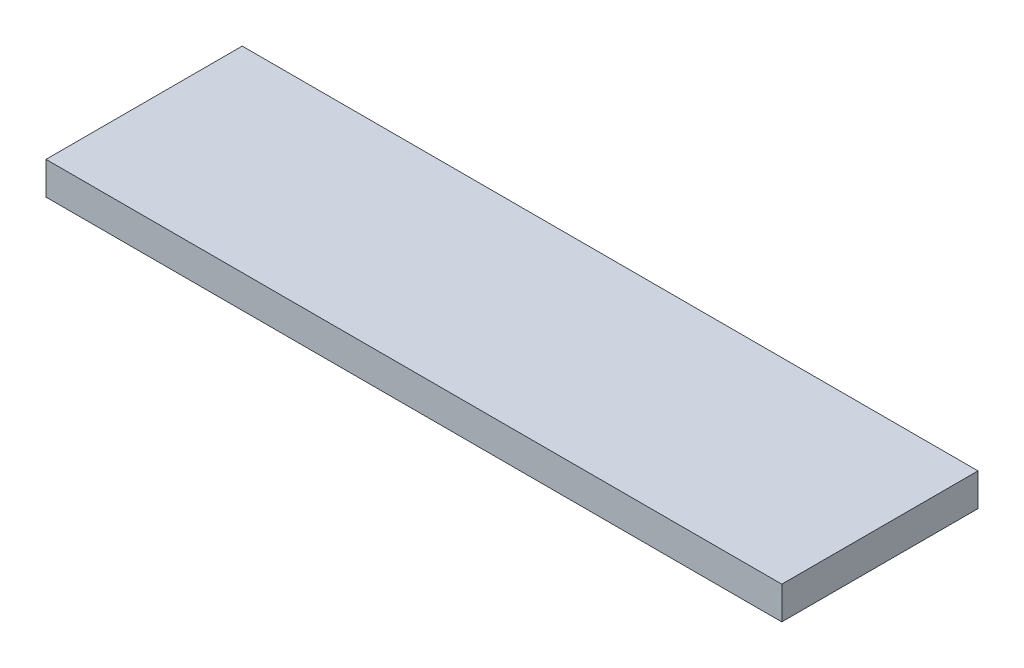
ISO-10303-21;
HEADER;
FILE_DESCRIPTION(('STEP AP214'),'2;1');
FILE_NAME('part.step','',(''),(''),'','','');
FILE_SCHEMA(('AUTOMOTIVE_DESIGN { 1 0 10303 214 1 1 1 1 }'));
ENDSEC;
DATA;
#1=APPLICATION_CONTEXT('core data for automotive mechanical design processes');
#2=APPLICATION_PROTOCOL_DEFINITION('international standard','automotive_design',2000,#1);
#3=PRODUCT_CONTEXT('',#1,'mechanical');
#4=PRODUCT('Part','Part','',(#3));
#5=PRODUCT_RELATED_PRODUCT_CATEGORY('part','',(#4));
#6=PRODUCT_DEFINITION_FORMATION('','',#4);
#7=PRODUCT_DEFINITION_CONTEXT('part definition',#1,'design');
#8=PRODUCT_DEFINITION('design','',#6,#7);
#9=PRODUCT_DEFINITION_SHAPE('','',#8);
#10=(LENGTH_UNIT() NAMED_UNIT(*) SI_UNIT(.MILLI.,.METRE.));
#11=(NAMED_UNIT(*) PLANE_ANGLE_UNIT() SI_UNIT($,.RADIAN.));
#12=(NAMED_UNIT(*) SI_UNIT($,.STERADIAN.) SOLID_ANGLE_UNIT());
#13=UNCERTAINTY_MEASURE_WITH_UNIT(LENGTH_MEASURE(1.E-05),#10,'distance_accuracy_value','');
#14=(GEOMETRIC_REPRESENTATION_CONTEXT(3) GLOBAL_UNCERTAINTY_ASSIGNED_CONTEXT((#13)) GLOBAL_UNIT_ASSIGNED_CONTEXT((#10,
#11,#12)) REPRESENTATION_CONTEXT('',''));
#15=CARTESIAN_POINT('',(0.,0.,0.));
#16=DIRECTION('',(0.,0.,1.));
#17=DIRECTION('',(1.,0.,0.));
#18=AXIS2_PLACEMENT_3D('',#15,#16,#17);
#19=CARTESIAN_POINT('',(0.,12.7,0.));
#20=DIRECTION('',(1.,0.,0.));
#21=DIRECTION('',(0.,0.,-1.));
#22=AXIS2_PLACEMENT_3D('',#19,#20,#21);
#23=PLANE('',#22);
#24=DIRECTION('',(0.,0.,1.));
#25=VECTOR('',#24,1.);
#26=CARTESIAN_POINT('',(0.,0.,0.));
#27=LINE('',#26,#25);
#28=CARTESIAN_POINT('',(0.,0.,-76.2));
#29=VERTEX_POINT('',#28);
#30=CARTESIAN_POINT('',(0.,0.,0.));
#31=VERTEX_POINT('',#30);
#32=EDGE_CURVE('E80',#29,#31,#27,.T.);
#33=ORIENTED_EDGE('',*,*,#32,.T.);
#34=DIRECTION('',(0.,-1.,0.));
#35=VECTOR('',#34,1.);
#36=CARTESIAN_POINT('',(0.,12.7,0.));
#37=LINE('',#36,#35);
#38=CARTESIAN_POINT('',(0.,12.7,0.));
#39=VERTEX_POINT('',#38);
#40=EDGE_CURVE('E11',#39,#31,#37,.T.);
#41=ORIENTED_EDGE('',*,*,#40,.F.);
#42=DIRECTION('',(0.,0.,1.));
#43=VECTOR('',#42,1.);
#44=CARTESIAN_POINT('',(0.,12.7,0.));
#45=LINE('',#44,#43);
#46=CARTESIAN_POINT('',(0.,12.7,-76.2));
#47=VERTEX_POINT('',#46);
#48=EDGE_CURVE('E68',#47,#39,#45,.T.);
#49=ORIENTED_EDGE('',*,*,#48,.F.);
#50=DIRECTION('',(0.,-1.,0.));
#51=VECTOR('',#50,1.);
#52=CARTESIAN_POINT('',(0.,12.7,-76.2));
#53=LINE('',#52,#51);
#54=EDGE_CURVE('E76',#47,#29,#53,.T.);
#55=ORIENTED_EDGE('',*,*,#54,.T.);
#56=EDGE_LOOP('',(#33,#41,#49,#55));
#57=FACE_BOUND('',#56,.T.);
#58=ADVANCED_FACE('F17',(#57),#23,.F.);
#59=CARTESIAN_POINT('',(0.,12.7,0.));
#60=DIRECTION('',(0.,0.,-1.));
#61=DIRECTION('',(-1.,0.,0.));
#62=AXIS2_PLACEMENT_3D('',#59,#60,#61);
#63=PLANE('',#62);
#64=DIRECTION('',(1.,0.,0.));
#65=VECTOR('',#64,1.);
#66=CARTESIAN_POINT('',(0.,0.,0.));
#67=LINE('',#66,#65);
#68=CARTESIAN_POINT('',(285.75,0.,0.));
#69=VERTEX_POINT('',#68);
#70=EDGE_CURVE('E72',#31,#69,#67,.T.);
#71=ORIENTED_EDGE('',*,*,#70,.T.);
#72=DIRECTION('',(0.,-1.,0.));
#73=VECTOR('',#72,1.);
#74=CARTESIAN_POINT('',(285.75,12.7,0.));
#75=LINE('',#74,#73);
#76=CARTESIAN_POINT('',(285.75,12.7,0.));
#77=VERTEX_POINT('',#76);
#78=EDGE_CURVE('E25',#77,#69,#75,.T.);
#79=ORIENTED_EDGE('',*,*,#78,.F.);
#80=DIRECTION('',(1.,0.,0.));
#81=VECTOR('',#80,1.);
#82=CARTESIAN_POINT('',(0.,12.7,0.));
#83=LINE('',#82,#81);
#84=EDGE_CURVE('E63',#39,#77,#83,.T.);
#85=ORIENTED_EDGE('',*,*,#84,.F.);
#86=ORIENTED_EDGE('',*,*,#40,.T.);
#87=EDGE_LOOP('',(#71,#79,#85,#86));
#88=FACE_BOUND('',#87,.T.);
#89=ADVANCED_FACE('F71',(#88),#63,.F.);
#90=CARTESIAN_POINT('',(285.75,12.7,0.));
#91=DIRECTION('',(-1.,0.,0.));
#92=DIRECTION('',(0.,0.,1.));
#93=AXIS2_PLACEMENT_3D('',#90,#91,#92);
#94=PLANE('',#93);
#95=DIRECTION('',(0.,0.,-1.));
#96=VECTOR('',#95,1.);
#97=CARTESIAN_POINT('',(285.75,0.,0.));
#98=LINE('',#97,#96);
#99=CARTESIAN_POINT('',(285.75,0.,-76.2));
#100=VERTEX_POINT('',#99);
#101=EDGE_CURVE('E50',#69,#100,#98,.T.);
#102=ORIENTED_EDGE('',*,*,#101,.T.);
#103=DIRECTION('',(0.,-1.,0.));
#104=VECTOR('',#103,1.);
#105=CARTESIAN_POINT('',(285.75,12.7,-76.2));
#106=LINE('',#105,#104);
#107=CARTESIAN_POINT('',(285.75,12.7,-76.2));
#108=VERTEX_POINT('',#107);
#109=EDGE_CURVE('E73',#108,#100,#106,.T.);
#110=ORIENTED_EDGE('',*,*,#109,.F.);
#111=DIRECTION('',(0.,0.,-1.));
#112=VECTOR('',#111,1.);
#113=CARTESIAN_POINT('',(285.75,12.7,0.));
#114=LINE('',#113,#112);
#115=EDGE_CURVE('E66',#77,#108,#114,.T.);
#116=ORIENTED_EDGE('',*,*,#115,.F.);
#117=ORIENTED_EDGE('',*,*,#78,.T.);
#118=EDGE_LOOP('',(#102,#110,#116,#117));
#119=FACE_BOUND('',#118,.T.);
#120=ADVANCED_FACE('F74',(#119),#94,.F.);
#121=CARTESIAN_POINT('',(0.,12.7,-76.2));
#122=DIRECTION('',(0.,0.,1.));
#123=DIRECTION('',(1.,0.,0.));
#124=AXIS2_PLACEMENT_3D('',#121,#122,#123);
#125=PLANE('',#124);
#126=DIRECTION('',(-1.,0.,0.));
#127=VECTOR('',#126,1.);
#128=CARTESIAN_POINT('',(0.,0.,-76.2));
#129=LINE('',#128,#127);
#130=EDGE_CURVE('E56',#100,#29,#129,.T.);
#131=ORIENTED_EDGE('',*,*,#130,.T.);
#132=ORIENTED_EDGE('',*,*,#54,.F.);
#133=DIRECTION('',(-1.,0.,0.));
#134=VECTOR('',#133,1.);
#135=CARTESIAN_POINT('',(0.,12.7,-76.2));
#136=LINE('',#135,#134);
#137=EDGE_CURVE('E33',#108,#47,#136,.T.);
#138=ORIENTED_EDGE('',*,*,#137,.F.);
#139=ORIENTED_EDGE('',*,*,#109,.T.);
#140=EDGE_LOOP('',(#131,#132,#138,#139));
#141=FACE_BOUND('',#140,.T.);
#142=ADVANCED_FACE('F87',(#141),#125,.F.);
#143=CARTESIAN_POINT('',(0.,12.7,-76.2));
#144=DIRECTION('',(0.,-1.,0.));
#145=DIRECTION('',(0.,0.,-1.));
#146=AXIS2_PLACEMENT_3D('',#143,#144,#145);
#147=PLANE('',#146);
#148=ORIENTED_EDGE('',*,*,#48,.T.);
#149=ORIENTED_EDGE('',*,*,#84,.T.);
#150=ORIENTED_EDGE('',*,*,#115,.T.);
#151=ORIENTED_EDGE('',*,*,#137,.T.);
#152=EDGE_LOOP('',(#148,#149,#150,#151));
#153=FACE_BOUND('',#152,.T.);
#154=ADVANCED_FACE('F64',(#153),#147,.F.);
#155=CARTESIAN_POINT('',(0.,0.,-76.2));
#156=DIRECTION('',(0.,-1.,0.));
#157=DIRECTION('',(0.,0.,-1.));
#158=AXIS2_PLACEMENT_3D('',#155,#156,#157);
#159=PLANE('',#158);
#160=ORIENTED_EDGE('',*,*,#32,.F.);
#161=ORIENTED_EDGE('',*,*,#130,.F.);
#162=ORIENTED_EDGE('',*,*,#101,.F.);
#163=ORIENTED_EDGE('',*,*,#70,.F.);
#164=EDGE_LOOP('',(#160,#161,#162,#163));
#165=FACE_BOUND('',#164,.T.);
#166=ADVANCED_FACE('F90',(#165),#159,.T.);
#167=CLOSED_SHELL('',(#58,#89,#120,#142,#154,#166));
#168=MANIFOLD_SOLID_BREP('B1',#167);
#169=ADVANCED_BREP_SHAPE_REPRESENTATION('',(#18,#168),#14);
#170=SHAPE_DEFINITION_REPRESENTATION(#9,#169);
ENDSEC;
END-ISO-10303-21;
